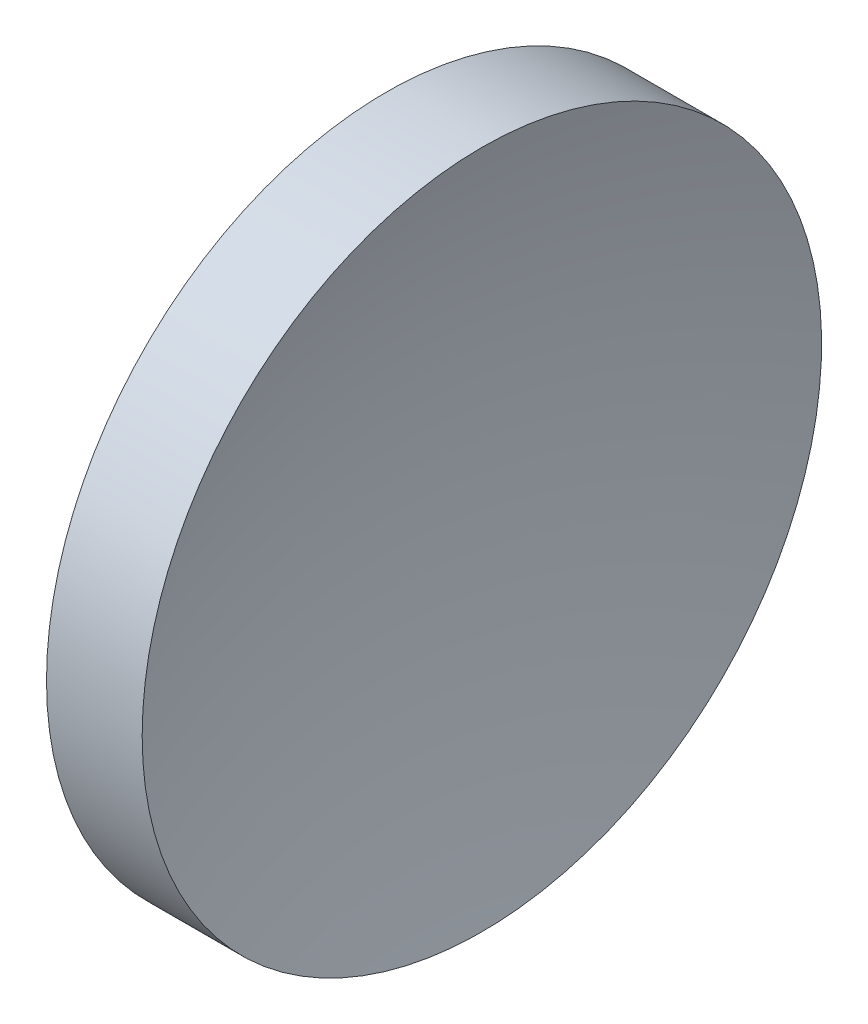
ISO-10303-21;
HEADER;
FILE_DESCRIPTION(('STEP AP214'),'2;1');
FILE_NAME('part.step','',(''),(''),'','','');
FILE_SCHEMA(('AUTOMOTIVE_DESIGN { 1 0 10303 214 1 1 1 1 }'));
ENDSEC;
DATA;
#1=APPLICATION_CONTEXT('core data for automotive mechanical design processes');
#2=APPLICATION_PROTOCOL_DEFINITION('international standard','automotive_design',2000,#1);
#3=PRODUCT_CONTEXT('',#1,'mechanical');
#4=PRODUCT('Part','Part','',(#3));
#5=PRODUCT_RELATED_PRODUCT_CATEGORY('part','',(#4));
#6=PRODUCT_DEFINITION_FORMATION('','',#4);
#7=PRODUCT_DEFINITION_CONTEXT('part definition',#1,'design');
#8=PRODUCT_DEFINITION('design','',#6,#7);
#9=PRODUCT_DEFINITION_SHAPE('','',#8);
#10=(LENGTH_UNIT() NAMED_UNIT(*) SI_UNIT(.MILLI.,.METRE.));
#11=(NAMED_UNIT(*) PLANE_ANGLE_UNIT() SI_UNIT($,.RADIAN.));
#12=(NAMED_UNIT(*) SI_UNIT($,.STERADIAN.) SOLID_ANGLE_UNIT());
#13=UNCERTAINTY_MEASURE_WITH_UNIT(LENGTH_MEASURE(1.E-05),#10,'distance_accuracy_value','');
#14=(GEOMETRIC_REPRESENTATION_CONTEXT(3) GLOBAL_UNCERTAINTY_ASSIGNED_CONTEXT((#13)) GLOBAL_UNIT_ASSIGNED_CONTEXT((#10,
#11,#12)) REPRESENTATION_CONTEXT('',''));
#15=CARTESIAN_POINT('',(0.,0.,0.));
#16=DIRECTION('',(0.,0.,1.));
#17=DIRECTION('',(1.,0.,0.));
#18=AXIS2_PLACEMENT_3D('',#15,#16,#17);
#19=CARTESIAN_POINT('',(194.23989283995,65.1556304570152,0.));
#20=DIRECTION('',(-1.,0.,0.));
#21=DIRECTION('',(0.,1.,0.));
#22=AXIS2_PLACEMENT_3D('',#19,#20,#21);
#23=SPHERICAL_SURFACE('',#22,77.52);
#24=CARTESIAN_POINT('',(120.057008021415,65.1556304570152,0.));
#25=DIRECTION('',(-1.,0.,0.));
#26=DIRECTION('',(0.,0.,1.));
#27=AXIS2_PLACEMENT_3D('',#24,#25,#26);
#28=CIRCLE('',#27,22.5);
#29=CARTESIAN_POINT('',(120.057008021415,65.1556304570152,22.5));
#30=VERTEX_POINT('',#29);
#31=EDGE_CURVE('E10',#30,#30,#28,.T.);
#32=ORIENTED_EDGE('',*,*,#31,.F.);
#33=EDGE_LOOP('',(#32));
#34=FACE_BOUND('',#33,.T.);
#35=ADVANCED_FACE('F35',(#34),#23,.F.);
#36=CARTESIAN_POINT('',(105.62183712383,65.1556304570152,0.));
#37=DIRECTION('',(-1.,0.,0.));
#38=DIRECTION('',(0.,0.,1.));
#39=AXIS2_PLACEMENT_3D('',#36,#37,#38);
#40=CYLINDRICAL_SURFACE('',#39,22.5);
#41=CARTESIAN_POINT('',(113.71989283995,65.1556304570152,0.));
#42=DIRECTION('',(-1.,0.,0.));
#43=DIRECTION('',(0.,0.,1.));
#44=AXIS2_PLACEMENT_3D('',#41,#42,#43);
#45=CIRCLE('',#44,22.5);
#46=CARTESIAN_POINT('',(113.71989283995,65.1556304570152,22.5));
#47=VERTEX_POINT('',#46);
#48=EDGE_CURVE('E41',#47,#47,#45,.T.);
#49=ORIENTED_EDGE('',*,*,#48,.F.);
#50=EDGE_LOOP('',(#49));
#51=FACE_BOUND('',#50,.T.);
#52=ORIENTED_EDGE('',*,*,#31,.T.);
#53=EDGE_LOOP('',(#52));
#54=FACE_BOUND('',#53,.T.);
#55=ADVANCED_FACE('F49',(#51,#54),#40,.T.);
#56=CARTESIAN_POINT('',(113.71989283995,65.1556304570152,0.));
#57=DIRECTION('',(1.,0.,0.));
#58=DIRECTION('',(0.,0.,-1.));
#59=AXIS2_PLACEMENT_3D('',#56,#57,#58);
#60=PLANE('',#59);
#61=ORIENTED_EDGE('',*,*,#48,.T.);
#62=EDGE_LOOP('',(#61));
#63=FACE_BOUND('',#62,.T.);
#64=ADVANCED_FACE('F47',(#63),#60,.F.);
#65=CLOSED_SHELL('',(#35,#55,#64));
#66=MANIFOLD_SOLID_BREP('B2',#65);
#67=ADVANCED_BREP_SHAPE_REPRESENTATION('',(#18,#66),#14);
#68=SHAPE_DEFINITION_REPRESENTATION(#9,#67);
ENDSEC;
END-ISO-10303-21;
